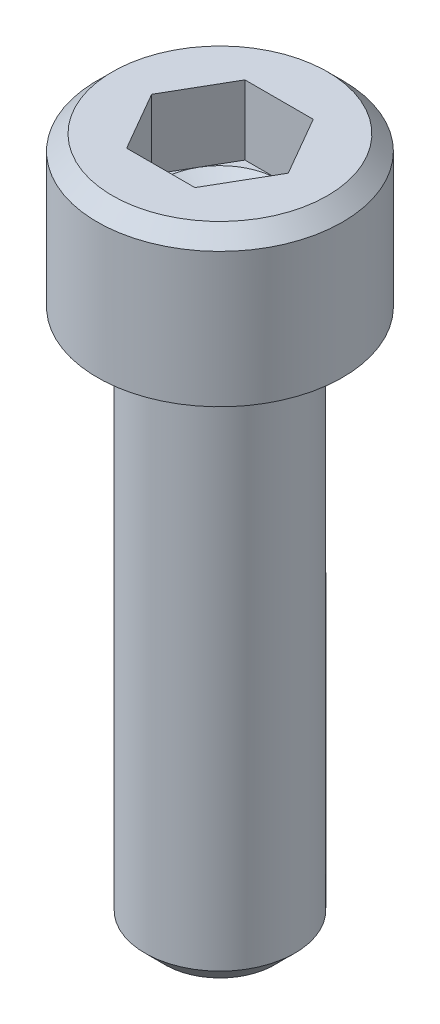
ISO-10303-21;
HEADER;
FILE_DESCRIPTION(('STEP AP214'),'2;1');
FILE_NAME('part.step','',(''),(''),'','','');
FILE_SCHEMA(('AUTOMOTIVE_DESIGN { 1 0 10303 214 1 1 1 1 }'));
ENDSEC;
DATA;
#1=APPLICATION_CONTEXT('core data for automotive mechanical design processes');
#2=APPLICATION_PROTOCOL_DEFINITION('international standard','automotive_design',2000,#1);
#3=PRODUCT_CONTEXT('',#1,'mechanical');
#4=PRODUCT('Part','Part','',(#3));
#5=PRODUCT_RELATED_PRODUCT_CATEGORY('part','',(#4));
#6=PRODUCT_DEFINITION_FORMATION('','',#4);
#7=PRODUCT_DEFINITION_CONTEXT('part definition',#1,'design');
#8=PRODUCT_DEFINITION('design','',#6,#7);
#9=PRODUCT_DEFINITION_SHAPE('','',#8);
#10=(LENGTH_UNIT() NAMED_UNIT(*) SI_UNIT(.MILLI.,.METRE.));
#11=(NAMED_UNIT(*) PLANE_ANGLE_UNIT() SI_UNIT($,.RADIAN.));
#12=(NAMED_UNIT(*) SI_UNIT($,.STERADIAN.) SOLID_ANGLE_UNIT());
#13=UNCERTAINTY_MEASURE_WITH_UNIT(LENGTH_MEASURE(1.E-05),#10,'distance_accuracy_value','');
#14=(GEOMETRIC_REPRESENTATION_CONTEXT(3) GLOBAL_UNCERTAINTY_ASSIGNED_CONTEXT((#13)) GLOBAL_UNIT_ASSIGNED_CONTEXT((#10,
#11,#12)) REPRESENTATION_CONTEXT('',''));
#15=CARTESIAN_POINT('',(0.,0.,0.));
#16=DIRECTION('',(0.,0.,1.));
#17=DIRECTION('',(1.,0.,0.));
#18=AXIS2_PLACEMENT_3D('',#15,#16,#17);
#19=CARTESIAN_POINT('',(0.,1.87959999988152,0.));
#20=DIRECTION('',(0.,1.,0.));
#21=DIRECTION('',(0.,0.,1.));
#22=AXIS2_PLACEMENT_3D('',#19,#20,#21);
#23=CONICAL_SURFACE('',#22,1.38429999981327,1.04719755105418);
#24=CARTESIAN_POINT('',(0.,1.08037402230821,-1.70530256582424E-10));
#25=VERTEX_POINT('',#24);
#26=VERTEX_LOOP('',#25);
#27=FACE_BOUND('',#26,.T.);
#28=CARTESIAN_POINT('',(0.,1.87959999997998,0.));
#29=DIRECTION('',(0.,1.,0.));
#30=DIRECTION('',(0.,0.,1.));
#31=AXIS2_PLACEMENT_3D('',#28,#29,#30);
#32=CIRCLE('',#31,1.3842999999838);
#33=CARTESIAN_POINT('',(-1.19883896645178,1.87959999998999,-0.692149999995949));
#34=VERTEX_POINT('',#33);
#35=CARTESIAN_POINT('',(0.,1.87959999998999,-1.3842999999919));
#36=VERTEX_POINT('',#35);
#37=EDGE_CURVE('E148',#34,#36,#32,.F.);
#38=ORIENTED_EDGE('',*,*,#37,.F.);
#39=CARTESIAN_POINT('',(0.,1.87959999997998,0.));
#40=DIRECTION('',(0.,1.,0.));
#41=DIRECTION('',(0.,0.,1.));
#42=AXIS2_PLACEMENT_3D('',#39,#40,#41);
#43=CIRCLE('',#42,1.3842999999838);
#44=CARTESIAN_POINT('',(-1.19883896645178,1.87959999998999,0.692149999995947));
#45=VERTEX_POINT('',#44);
#46=EDGE_CURVE('E95',#45,#34,#43,.F.);
#47=ORIENTED_EDGE('',*,*,#46,.F.);
#48=CARTESIAN_POINT('',(0.,1.87959999997998,0.));
#49=DIRECTION('',(0.,1.,0.));
#50=DIRECTION('',(0.,0.,1.));
#51=AXIS2_PLACEMENT_3D('',#48,#49,#50);
#52=CIRCLE('',#51,1.3842999999838);
#53=CARTESIAN_POINT('',(0.,1.87959999998999,1.3842999999919));
#54=VERTEX_POINT('',#53);
#55=EDGE_CURVE('E91',#54,#45,#52,.F.);
#56=ORIENTED_EDGE('',*,*,#55,.F.);
#57=CARTESIAN_POINT('',(0.,1.87959999997998,0.));
#58=DIRECTION('',(0.,1.,0.));
#59=DIRECTION('',(0.,0.,1.));
#60=AXIS2_PLACEMENT_3D('',#57,#58,#59);
#61=CIRCLE('',#60,1.3842999999838);
#62=CARTESIAN_POINT('',(1.19883896645178,1.87959999998999,0.692149999995948));
#63=VERTEX_POINT('',#62);
#64=EDGE_CURVE('E89',#63,#54,#61,.F.);
#65=ORIENTED_EDGE('',*,*,#64,.F.);
#66=CARTESIAN_POINT('',(0.,1.87959999997998,0.));
#67=DIRECTION('',(0.,1.,0.));
#68=DIRECTION('',(0.,0.,1.));
#69=AXIS2_PLACEMENT_3D('',#66,#67,#68);
#70=CIRCLE('',#69,1.3842999999838);
#71=CARTESIAN_POINT('',(1.19883896645178,1.87959999998999,-0.692149999995948));
#72=VERTEX_POINT('',#71);
#73=EDGE_CURVE('E19',#72,#63,#70,.F.);
#74=ORIENTED_EDGE('',*,*,#73,.F.);
#75=CARTESIAN_POINT('',(0.,1.87959999997998,0.));
#76=DIRECTION('',(0.,1.,0.));
#77=DIRECTION('',(0.,0.,1.));
#78=AXIS2_PLACEMENT_3D('',#75,#76,#77);
#79=CIRCLE('',#78,1.3842999999838);
#80=EDGE_CURVE('E106',#36,#72,#79,.F.);
#81=ORIENTED_EDGE('',*,*,#80,.F.);
#82=EDGE_LOOP('',(#38,#47,#56,#65,#74,#81));
#83=FACE_BOUND('',#82,.T.);
#84=ADVANCED_FACE('F16',(#27,#83),#23,.F.);
#85=CARTESIAN_POINT('',(0.,1.8796,0.));
#86=DIRECTION('',(0.,1.,0.));
#87=DIRECTION('',(0.,0.,1.));
#88=AXIS2_PLACEMENT_3D('',#85,#86,#87);
#89=PLANE('',#88);
#90=DIRECTION('',(0.5,0.,-0.866025403784438));
#91=VECTOR('',#90,1.);
#92=CARTESIAN_POINT('',(0.799225977639199,1.8796,1.3843));
#93=LINE('',#92,#91);
#94=CARTESIAN_POINT('',(1.5984519552784,1.8796,0.));
#95=VERTEX_POINT('',#94);
#96=EDGE_CURVE('E101',#63,#95,#93,.T.);
#97=ORIENTED_EDGE('',*,*,#96,.T.);
#98=DIRECTION('',(-0.499999999999999,0.,-0.866025403784439));
#99=VECTOR('',#98,1.);
#100=CARTESIAN_POINT('',(1.5984519552784,1.8796,0.));
#101=LINE('',#100,#99);
#102=EDGE_CURVE('E104',#95,#72,#101,.T.);
#103=ORIENTED_EDGE('',*,*,#102,.T.);
#104=ORIENTED_EDGE('',*,*,#73,.T.);
#105=EDGE_LOOP('',(#97,#103,#104));
#106=FACE_BOUND('',#105,.T.);
#107=ADVANCED_FACE('F99',(#106),#89,.T.);
#108=CARTESIAN_POINT('',(0.,1.8796,0.));
#109=DIRECTION('',(0.,1.,0.));
#110=DIRECTION('',(0.,0.,1.));
#111=AXIS2_PLACEMENT_3D('',#108,#109,#110);
#112=PLANE('',#111);
#113=DIRECTION('',(-0.499999999999999,0.,-0.866025403784439));
#114=VECTOR('',#113,1.);
#115=CARTESIAN_POINT('',(1.5984519552784,1.8796,0.));
#116=LINE('',#115,#114);
#117=CARTESIAN_POINT('',(0.799225977639201,1.8796,-1.3843));
#118=VERTEX_POINT('',#117);
#119=EDGE_CURVE('E115',#72,#118,#116,.T.);
#120=ORIENTED_EDGE('',*,*,#119,.T.);
#121=DIRECTION('',(-1.,0.,0.));
#122=VECTOR('',#121,1.);
#123=CARTESIAN_POINT('',(0.799225977639201,1.8796,-1.3843));
#124=LINE('',#123,#122);
#125=EDGE_CURVE('E155',#118,#36,#124,.T.);
#126=ORIENTED_EDGE('',*,*,#125,.T.);
#127=ORIENTED_EDGE('',*,*,#80,.T.);
#128=EDGE_LOOP('',(#120,#126,#127));
#129=FACE_BOUND('',#128,.T.);
#130=ADVANCED_FACE('F152',(#129),#112,.T.);
#131=CARTESIAN_POINT('',(0.,1.8796,0.));
#132=DIRECTION('',(0.,1.,0.));
#133=DIRECTION('',(0.,0.,1.));
#134=AXIS2_PLACEMENT_3D('',#131,#132,#133);
#135=PLANE('',#134);
#136=DIRECTION('',(-1.,0.,0.));
#137=VECTOR('',#136,1.);
#138=CARTESIAN_POINT('',(0.799225977639201,1.8796,-1.3843));
#139=LINE('',#138,#137);
#140=CARTESIAN_POINT('',(-0.799225977639196,1.8796,-1.3843));
#141=VERTEX_POINT('',#140);
#142=EDGE_CURVE('E160',#36,#141,#139,.T.);
#143=ORIENTED_EDGE('',*,*,#142,.T.);
#144=DIRECTION('',(-0.5,0.,0.866025403784438));
#145=VECTOR('',#144,1.);
#146=CARTESIAN_POINT('',(-0.799225977639196,1.8796,-1.3843));
#147=LINE('',#146,#145);
#148=EDGE_CURVE('E163',#141,#34,#147,.T.);
#149=ORIENTED_EDGE('',*,*,#148,.T.);
#150=ORIENTED_EDGE('',*,*,#37,.T.);
#151=EDGE_LOOP('',(#143,#149,#150));
#152=FACE_BOUND('',#151,.T.);
#153=ADVANCED_FACE('F159',(#152),#135,.T.);
#154=CARTESIAN_POINT('',(0.,1.8796,0.));
#155=DIRECTION('',(0.,1.,0.));
#156=DIRECTION('',(0.,0.,1.));
#157=AXIS2_PLACEMENT_3D('',#154,#155,#156);
#158=PLANE('',#157);
#159=DIRECTION('',(-0.5,0.,0.866025403784438));
#160=VECTOR('',#159,1.);
#161=CARTESIAN_POINT('',(-0.799225977639196,1.8796,-1.3843));
#162=LINE('',#161,#160);
#163=CARTESIAN_POINT('',(-1.5984519552784,1.8796,0.));
#164=VERTEX_POINT('',#163);
#165=EDGE_CURVE('E171',#34,#164,#162,.T.);
#166=ORIENTED_EDGE('',*,*,#165,.T.);
#167=DIRECTION('',(0.5,0.,0.866025403784439));
#168=VECTOR('',#167,1.);
#169=CARTESIAN_POINT('',(-1.5984519552784,1.8796,0.));
#170=LINE('',#169,#168);
#171=EDGE_CURVE('E230',#164,#45,#170,.T.);
#172=ORIENTED_EDGE('',*,*,#171,.T.);
#173=ORIENTED_EDGE('',*,*,#46,.T.);
#174=EDGE_LOOP('',(#166,#172,#173));
#175=FACE_BOUND('',#174,.T.);
#176=ADVANCED_FACE('F335',(#175),#158,.T.);
#177=CARTESIAN_POINT('',(0.,1.8796,0.));
#178=DIRECTION('',(0.,1.,0.));
#179=DIRECTION('',(0.,0.,1.));
#180=AXIS2_PLACEMENT_3D('',#177,#178,#179);
#181=PLANE('',#180);
#182=DIRECTION('',(1.,0.,0.));
#183=VECTOR('',#182,1.);
#184=CARTESIAN_POINT('',(-0.799225977639198,1.8796,1.3843));
#185=LINE('',#184,#183);
#186=CARTESIAN_POINT('',(0.799225977639199,1.8796,1.3843));
#187=VERTEX_POINT('',#186);
#188=EDGE_CURVE('E111',#54,#187,#185,.T.);
#189=ORIENTED_EDGE('',*,*,#188,.T.);
#190=DIRECTION('',(0.5,0.,-0.866025403784438));
#191=VECTOR('',#190,1.);
#192=CARTESIAN_POINT('',(0.799225977639199,1.8796,1.3843));
#193=LINE('',#192,#191);
#194=EDGE_CURVE('E108',#187,#63,#193,.T.);
#195=ORIENTED_EDGE('',*,*,#194,.T.);
#196=ORIENTED_EDGE('',*,*,#64,.T.);
#197=EDGE_LOOP('',(#189,#195,#196));
#198=FACE_BOUND('',#197,.T.);
#199=ADVANCED_FACE('F109',(#198),#181,.T.);
#200=CARTESIAN_POINT('',(0.,1.8796,0.));
#201=DIRECTION('',(0.,1.,0.));
#202=DIRECTION('',(0.,0.,1.));
#203=AXIS2_PLACEMENT_3D('',#200,#201,#202);
#204=PLANE('',#203);
#205=DIRECTION('',(0.5,0.,0.866025403784439));
#206=VECTOR('',#205,1.);
#207=CARTESIAN_POINT('',(-1.5984519552784,1.8796,0.));
#208=LINE('',#207,#206);
#209=CARTESIAN_POINT('',(-0.799225977639199,1.8796,1.3843));
#210=VERTEX_POINT('',#209);
#211=EDGE_CURVE('E167',#45,#210,#208,.T.);
#212=ORIENTED_EDGE('',*,*,#211,.T.);
#213=DIRECTION('',(1.,0.,0.));
#214=VECTOR('',#213,1.);
#215=CARTESIAN_POINT('',(-0.799225977639198,1.8796,1.3843));
#216=LINE('',#215,#214);
#217=EDGE_CURVE('E131',#210,#54,#216,.T.);
#218=ORIENTED_EDGE('',*,*,#217,.T.);
#219=ORIENTED_EDGE('',*,*,#55,.T.);
#220=EDGE_LOOP('',(#212,#218,#219));
#221=FACE_BOUND('',#220,.T.);
#222=ADVANCED_FACE('F329',(#221),#204,.T.);
#223=CARTESIAN_POINT('',(0.799225977639199,3.5052,1.3843));
#224=DIRECTION('',(0.866025403784438,0.,0.5));
#225=DIRECTION('',(0.5,0.,-0.866025403784438));
#226=AXIS2_PLACEMENT_3D('',#223,#224,#225);
#227=PLANE('',#226);
#228=DIRECTION('',(0.,1.,0.));
#229=VECTOR('',#228,1.);
#230=CARTESIAN_POINT('',(0.799225977639199,3.5052,1.3843));
#231=LINE('',#230,#229);
#232=CARTESIAN_POINT('',(0.799225977639199,3.5052,1.3843));
#233=VERTEX_POINT('',#232);
#234=EDGE_CURVE('E238',#187,#233,#231,.T.);
#235=ORIENTED_EDGE('',*,*,#234,.T.);
#236=DIRECTION('',(0.500000000000001,0.,-0.866025403784438));
#237=VECTOR('',#236,1.);
#238=CARTESIAN_POINT('',(0.799225977639199,3.5052,1.3843));
#239=LINE('',#238,#237);
#240=CARTESIAN_POINT('',(1.5984519552784,3.5052,0.));
#241=VERTEX_POINT('',#240);
#242=EDGE_CURVE('E128',#233,#241,#239,.T.);
#243=ORIENTED_EDGE('',*,*,#242,.T.);
#244=DIRECTION('',(0.,1.,0.));
#245=VECTOR('',#244,1.);
#246=CARTESIAN_POINT('',(1.5984519552784,3.5052,0.));
#247=LINE('',#246,#245);
#248=EDGE_CURVE('E119',#241,#95,#247,.F.);
#249=ORIENTED_EDGE('',*,*,#248,.T.);
#250=ORIENTED_EDGE('',*,*,#96,.F.);
#251=ORIENTED_EDGE('',*,*,#194,.F.);
#252=EDGE_LOOP('',(#235,#243,#249,#250,#251));
#253=FACE_BOUND('',#252,.T.);
#254=ADVANCED_FACE('F117',(#253),#227,.F.);
#255=CARTESIAN_POINT('',(1.5984519552784,3.5052,0.));
#256=DIRECTION('',(0.866025403784439,0.,-0.499999999999999));
#257=DIRECTION('',(-0.499999999999999,0.,-0.866025403784439));
#258=AXIS2_PLACEMENT_3D('',#255,#256,#257);
#259=PLANE('',#258);
#260=ORIENTED_EDGE('',*,*,#248,.F.);
#261=DIRECTION('',(-0.5,0.,-0.866025403784439));
#262=VECTOR('',#261,1.);
#263=CARTESIAN_POINT('',(1.5984519552784,3.5052,0.));
#264=LINE('',#263,#262);
#265=CARTESIAN_POINT('',(0.799225977639201,3.5052,-1.3843));
#266=VERTEX_POINT('',#265);
#267=EDGE_CURVE('E130',#241,#266,#264,.T.);
#268=ORIENTED_EDGE('',*,*,#267,.T.);
#269=DIRECTION('',(0.,1.,0.));
#270=VECTOR('',#269,1.);
#271=CARTESIAN_POINT('',(0.799225977639201,3.5052,-1.3843));
#272=LINE('',#271,#270);
#273=EDGE_CURVE('E179',#266,#118,#272,.F.);
#274=ORIENTED_EDGE('',*,*,#273,.T.);
#275=ORIENTED_EDGE('',*,*,#119,.F.);
#276=ORIENTED_EDGE('',*,*,#102,.F.);
#277=EDGE_LOOP('',(#260,#268,#274,#275,#276));
#278=FACE_BOUND('',#277,.T.);
#279=ADVANCED_FACE('F218',(#278),#259,.F.);
#280=CARTESIAN_POINT('',(0.799225977639201,3.5052,-1.3843));
#281=DIRECTION('',(0.,0.,-1.));
#282=DIRECTION('',(-1.,0.,0.));
#283=AXIS2_PLACEMENT_3D('',#280,#281,#282);
#284=PLANE('',#283);
#285=ORIENTED_EDGE('',*,*,#273,.F.);
#286=DIRECTION('',(1.,0.,0.));
#287=VECTOR('',#286,1.);
#288=CARTESIAN_POINT('',(0.,3.5052,-1.3843));
#289=LINE('',#288,#287);
#290=CARTESIAN_POINT('',(-0.799225977639196,3.5052,-1.3843));
#291=VERTEX_POINT('',#290);
#292=EDGE_CURVE('E189',#266,#291,#289,.F.);
#293=ORIENTED_EDGE('',*,*,#292,.T.);
#294=DIRECTION('',(0.,1.,0.));
#295=VECTOR('',#294,1.);
#296=CARTESIAN_POINT('',(-0.799225977639196,3.5052,-1.3843));
#297=LINE('',#296,#295);
#298=EDGE_CURVE('E168',#291,#141,#297,.F.);
#299=ORIENTED_EDGE('',*,*,#298,.T.);
#300=ORIENTED_EDGE('',*,*,#142,.F.);
#301=ORIENTED_EDGE('',*,*,#125,.F.);
#302=EDGE_LOOP('',(#285,#293,#299,#300,#301));
#303=FACE_BOUND('',#302,.T.);
#304=ADVANCED_FACE('F223',(#303),#284,.F.);
#305=CARTESIAN_POINT('',(-0.799225977639196,3.5052,-1.3843));
#306=DIRECTION('',(-0.866025403784438,0.,-0.5));
#307=DIRECTION('',(-0.5,0.,0.866025403784438));
#308=AXIS2_PLACEMENT_3D('',#305,#306,#307);
#309=PLANE('',#308);
#310=ORIENTED_EDGE('',*,*,#298,.F.);
#311=DIRECTION('',(-0.500000000000003,0.,0.866025403784437));
#312=VECTOR('',#311,1.);
#313=CARTESIAN_POINT('',(-0.799225977639196,3.5052,-1.3843));
#314=LINE('',#313,#312);
#315=CARTESIAN_POINT('',(-1.5984519552784,3.5052,0.));
#316=VERTEX_POINT('',#315);
#317=EDGE_CURVE('E187',#291,#316,#314,.T.);
#318=ORIENTED_EDGE('',*,*,#317,.T.);
#319=DIRECTION('',(0.,1.,0.));
#320=VECTOR('',#319,1.);
#321=CARTESIAN_POINT('',(-1.5984519552784,3.5052,0.));
#322=LINE('',#321,#320);
#323=EDGE_CURVE('E173',#316,#164,#322,.F.);
#324=ORIENTED_EDGE('',*,*,#323,.T.);
#325=ORIENTED_EDGE('',*,*,#165,.F.);
#326=ORIENTED_EDGE('',*,*,#148,.F.);
#327=EDGE_LOOP('',(#310,#318,#324,#325,#326));
#328=FACE_BOUND('',#327,.T.);
#329=ADVANCED_FACE('F172',(#328),#309,.F.);
#330=CARTESIAN_POINT('',(-1.5984519552784,3.5052,0.));
#331=DIRECTION('',(-0.866025403784439,0.,0.5));
#332=DIRECTION('',(0.5,0.,0.866025403784439));
#333=AXIS2_PLACEMENT_3D('',#330,#331,#332);
#334=PLANE('',#333);
#335=ORIENTED_EDGE('',*,*,#323,.F.);
#336=DIRECTION('',(0.500000000000001,0.,0.866025403784438));
#337=VECTOR('',#336,1.);
#338=CARTESIAN_POINT('',(-1.5984519552784,3.5052,0.));
#339=LINE('',#338,#337);
#340=CARTESIAN_POINT('',(-0.799225977639198,3.5052,1.3843));
#341=VERTEX_POINT('',#340);
#342=EDGE_CURVE('E34',#316,#341,#339,.T.);
#343=ORIENTED_EDGE('',*,*,#342,.T.);
#344=DIRECTION('',(0.,1.,0.));
#345=VECTOR('',#344,1.);
#346=CARTESIAN_POINT('',(-0.799225977639198,3.5052,1.3843));
#347=LINE('',#346,#345);
#348=EDGE_CURVE('E240',#341,#210,#347,.F.);
#349=ORIENTED_EDGE('',*,*,#348,.T.);
#350=ORIENTED_EDGE('',*,*,#211,.F.);
#351=ORIENTED_EDGE('',*,*,#171,.F.);
#352=EDGE_LOOP('',(#335,#343,#349,#350,#351));
#353=FACE_BOUND('',#352,.T.);
#354=ADVANCED_FACE('F228',(#353),#334,.F.);
#355=CARTESIAN_POINT('',(-0.799225977639198,3.5052,1.3843));
#356=DIRECTION('',(0.,0.,1.));
#357=DIRECTION('',(1.,0.,0.));
#358=AXIS2_PLACEMENT_3D('',#355,#356,#357);
#359=PLANE('',#358);
#360=ORIENTED_EDGE('',*,*,#348,.F.);
#361=DIRECTION('',(1.,0.,0.));
#362=VECTOR('',#361,1.);
#363=CARTESIAN_POINT('',(0.,3.5052,1.3843));
#364=LINE('',#363,#362);
#365=EDGE_CURVE('E144',#341,#233,#364,.T.);
#366=ORIENTED_EDGE('',*,*,#365,.T.);
#367=ORIENTED_EDGE('',*,*,#234,.F.);
#368=ORIENTED_EDGE('',*,*,#188,.F.);
#369=ORIENTED_EDGE('',*,*,#217,.F.);
#370=EDGE_LOOP('',(#360,#366,#367,#368,#369));
#371=FACE_BOUND('',#370,.T.);
#372=ADVANCED_FACE('F315',(#371),#359,.F.);
#373=CARTESIAN_POINT('',(0.,3.5052,0.));
#374=DIRECTION('',(0.,-1.,0.));
#375=DIRECTION('',(0.,0.,-1.));
#376=AXIS2_PLACEMENT_3D('',#373,#374,#375);
#377=PLANE('',#376);
#378=ORIENTED_EDGE('',*,*,#342,.F.);
#379=ORIENTED_EDGE('',*,*,#317,.F.);
#380=ORIENTED_EDGE('',*,*,#292,.F.);
#381=ORIENTED_EDGE('',*,*,#267,.F.);
#382=ORIENTED_EDGE('',*,*,#242,.F.);
#383=ORIENTED_EDGE('',*,*,#365,.F.);
#384=EDGE_LOOP('',(#378,#379,#380,#381,#382,#383));
#385=FACE_BOUND('',#384,.T.);
#386=CARTESIAN_POINT('',(0.,3.50519999989274,0.));
#387=DIRECTION('',(0.,-1.,0.));
#388=DIRECTION('',(1.,0.,0.));
#389=AXIS2_PLACEMENT_3D('',#386,#387,#388);
#390=CIRCLE('',#389,2.51460000004045);
#391=CARTESIAN_POINT('',(2.51460000004045,3.50519999989274,0.));
#392=VERTEX_POINT('',#391);
#393=EDGE_CURVE('E142',#392,#392,#390,.T.);
#394=ORIENTED_EDGE('',*,*,#393,.F.);
#395=EDGE_LOOP('',(#394));
#396=FACE_BOUND('',#395,.T.);
#397=ADVANCED_FACE('F225',(#385,#396),#377,.F.);
#398=CARTESIAN_POINT('',(0.,3.149599999972,0.));
#399=DIRECTION('',(0.,-1.,0.));
#400=DIRECTION('',(1.,0.,0.));
#401=AXIS2_PLACEMENT_3D('',#398,#399,#400);
#402=CONICAL_SURFACE('',#401,2.87020000001803,0.785398163477374);
#403=CARTESIAN_POINT('',(0.,3.1496,0.));
#404=DIRECTION('',(0.,-1.,0.));
#405=DIRECTION('',(0.,0.,-1.));
#406=AXIS2_PLACEMENT_3D('',#403,#404,#405);
#407=CIRCLE('',#406,2.8702);
#408=CARTESIAN_POINT('',(0.,3.1496,-2.8702));
#409=VERTEX_POINT('',#408);
#410=EDGE_CURVE('E141',#409,#409,#407,.T.);
#411=ORIENTED_EDGE('',*,*,#410,.F.);
#412=EDGE_LOOP('',(#411));
#413=FACE_BOUND('',#412,.T.);
#414=ORIENTED_EDGE('',*,*,#393,.T.);
#415=EDGE_LOOP('',(#414));
#416=FACE_BOUND('',#415,.T.);
#417=ADVANCED_FACE('F308',(#413,#416),#402,.T.);
#418=CARTESIAN_POINT('',(0.,4.31546,0.));
#419=DIRECTION('',(0.,-1.,0.));
#420=DIRECTION('',(0.,0.,-1.));
#421=AXIS2_PLACEMENT_3D('',#418,#419,#420);
#422=CYLINDRICAL_SURFACE('',#421,2.8702);
#423=CARTESIAN_POINT('',(0.,0.,0.));
#424=DIRECTION('',(0.,-1.,0.));
#425=DIRECTION('',(0.,0.,-1.));
#426=AXIS2_PLACEMENT_3D('',#423,#424,#425);
#427=CIRCLE('',#426,2.8702);
#428=CARTESIAN_POINT('',(0.,0.,-2.8702));
#429=VERTEX_POINT('',#428);
#430=EDGE_CURVE('E138',#429,#429,#427,.T.);
#431=ORIENTED_EDGE('',*,*,#430,.F.);
#432=EDGE_LOOP('',(#431));
#433=FACE_BOUND('',#432,.T.);
#434=ORIENTED_EDGE('',*,*,#410,.T.);
#435=EDGE_LOOP('',(#434));
#436=FACE_BOUND('',#435,.T.);
#437=ADVANCED_FACE('F305',(#433,#436),#422,.T.);
#438=CARTESIAN_POINT('',(0.,0.,0.));
#439=DIRECTION('',(0.,-1.,0.));
#440=DIRECTION('',(0.,0.,-1.));
#441=AXIS2_PLACEMENT_3D('',#438,#439,#440);
#442=PLANE('',#441);
#443=CARTESIAN_POINT('',(0.,0.,0.));
#444=DIRECTION('',(0.,-1.,0.));
#445=DIRECTION('',(-1.,0.,-2.47618082076463E-13));
#446=AXIS2_PLACEMENT_3D('',#443,#444,#445);
#447=CIRCLE('',#446,2.0066);
#448=CARTESIAN_POINT('',(-2.0066,0.,-4.9687044349463E-13));
#449=VERTEX_POINT('',#448);
#450=EDGE_CURVE('E137',#449,#449,#447,.F.);
#451=ORIENTED_EDGE('',*,*,#450,.T.);
#452=EDGE_LOOP('',(#451));
#453=FACE_BOUND('',#452,.T.);
#454=ORIENTED_EDGE('',*,*,#430,.T.);
#455=EDGE_LOOP('',(#454));
#456=FACE_BOUND('',#455,.T.);
#457=ADVANCED_FACE('F296',(#453,#456),#442,.T.);
#458=CARTESIAN_POINT('',(0.,-12.7,0.));
#459=DIRECTION('',(0.,-1.,0.));
#460=DIRECTION('',(0.,0.,-1.));
#461=AXIS2_PLACEMENT_3D('',#458,#459,#460);
#462=PLANE('',#461);
#463=CARTESIAN_POINT('',(0.,-12.6999999999384,0.));
#464=DIRECTION('',(0.,1.,0.));
#465=DIRECTION('',(-1.,0.,0.));
#466=AXIS2_PLACEMENT_3D('',#463,#464,#465);
#467=CIRCLE('',#466,1.28015999996478);
#468=CARTESIAN_POINT('',(-1.28015999996478,-12.6999999999384,0.));
#469=VERTEX_POINT('',#468);
#470=EDGE_CURVE('E134',#469,#469,#467,.T.);
#471=ORIENTED_EDGE('',*,*,#470,.F.);
#472=EDGE_LOOP('',(#471));
#473=FACE_BOUND('',#472,.T.);
#474=ADVANCED_FACE('F283',(#473),#462,.T.);
#475=CARTESIAN_POINT('',(0.,-0.254,0.));
#476=DIRECTION('',(0.,-1.,0.));
#477=DIRECTION('',(0.,0.,-1.));
#478=AXIS2_PLACEMENT_3D('',#475,#476,#477);
#479=TOROIDAL_SURFACE('',#478,2.0066,0.254);
#480=CARTESIAN_POINT('',(0.,-0.254,0.));
#481=DIRECTION('',(0.,-1.,0.));
#482=DIRECTION('',(0.,0.,-1.));
#483=AXIS2_PLACEMENT_3D('',#480,#481,#482);
#484=CIRCLE('',#483,1.7526);
#485=CARTESIAN_POINT('',(0.,-0.254,-1.7526));
#486=VERTEX_POINT('',#485);
#487=EDGE_CURVE('E25',#486,#486,#484,.T.);
#488=ORIENTED_EDGE('',*,*,#487,.F.);
#489=EDGE_LOOP('',(#488));
#490=FACE_BOUND('',#489,.T.);
#491=ORIENTED_EDGE('',*,*,#450,.F.);
#492=EDGE_LOOP('',(#491));
#493=FACE_BOUND('',#492,.T.);
#494=ADVANCED_FACE('F271',(#490,#493),#479,.F.);
#495=CARTESIAN_POINT('',(0.,-12.2275599999853,0.));
#496=DIRECTION('',(0.,1.,0.));
#497=DIRECTION('',(-1.,0.,0.));
#498=AXIS2_PLACEMENT_3D('',#495,#496,#497);
#499=CONICAL_SURFACE('',#498,1.75259999991795,0.785398163397448);
#500=ORIENTED_EDGE('',*,*,#470,.T.);
#501=EDGE_LOOP('',(#500));
#502=FACE_BOUND('',#501,.T.);
#503=CARTESIAN_POINT('',(0.,-12.22756,0.));
#504=DIRECTION('',(0.,-1.,0.));
#505=DIRECTION('',(0.,0.,-1.));
#506=AXIS2_PLACEMENT_3D('',#503,#504,#505);
#507=CIRCLE('',#506,1.7526);
#508=CARTESIAN_POINT('',(0.,-12.22756,-1.7526));
#509=VERTEX_POINT('',#508);
#510=EDGE_CURVE('E11',#509,#509,#507,.F.);
#511=ORIENTED_EDGE('',*,*,#510,.F.);
#512=EDGE_LOOP('',(#511));
#513=FACE_BOUND('',#512,.T.);
#514=ADVANCED_FACE('F282',(#502,#513),#499,.T.);
#515=CARTESIAN_POINT('',(0.,4.31546,0.));
#516=DIRECTION('',(0.,-1.,0.));
#517=DIRECTION('',(0.,0.,-1.));
#518=AXIS2_PLACEMENT_3D('',#515,#516,#517);
#519=CYLINDRICAL_SURFACE('',#518,1.7526);
#520=ORIENTED_EDGE('',*,*,#510,.T.);
#521=EDGE_LOOP('',(#520));
#522=FACE_BOUND('',#521,.T.);
#523=ORIENTED_EDGE('',*,*,#487,.T.);
#524=EDGE_LOOP('',(#523));
#525=FACE_BOUND('',#524,.T.);
#526=ADVANCED_FACE('F347',(#522,#525),#519,.T.);
#527=CLOSED_SHELL('',(#84,#107,#130,#153,#176,#199,#222,#254,#279,#304,#329,#354,#372,#397,#417,
#437,#457,#474,#494,#514,#526));
#528=MANIFOLD_SOLID_BREP('B1',#527);
#529=ADVANCED_BREP_SHAPE_REPRESENTATION('',(#18,#528),#14);
#530=SHAPE_DEFINITION_REPRESENTATION(#9,#529);
ENDSEC;
END-ISO-10303-21;
